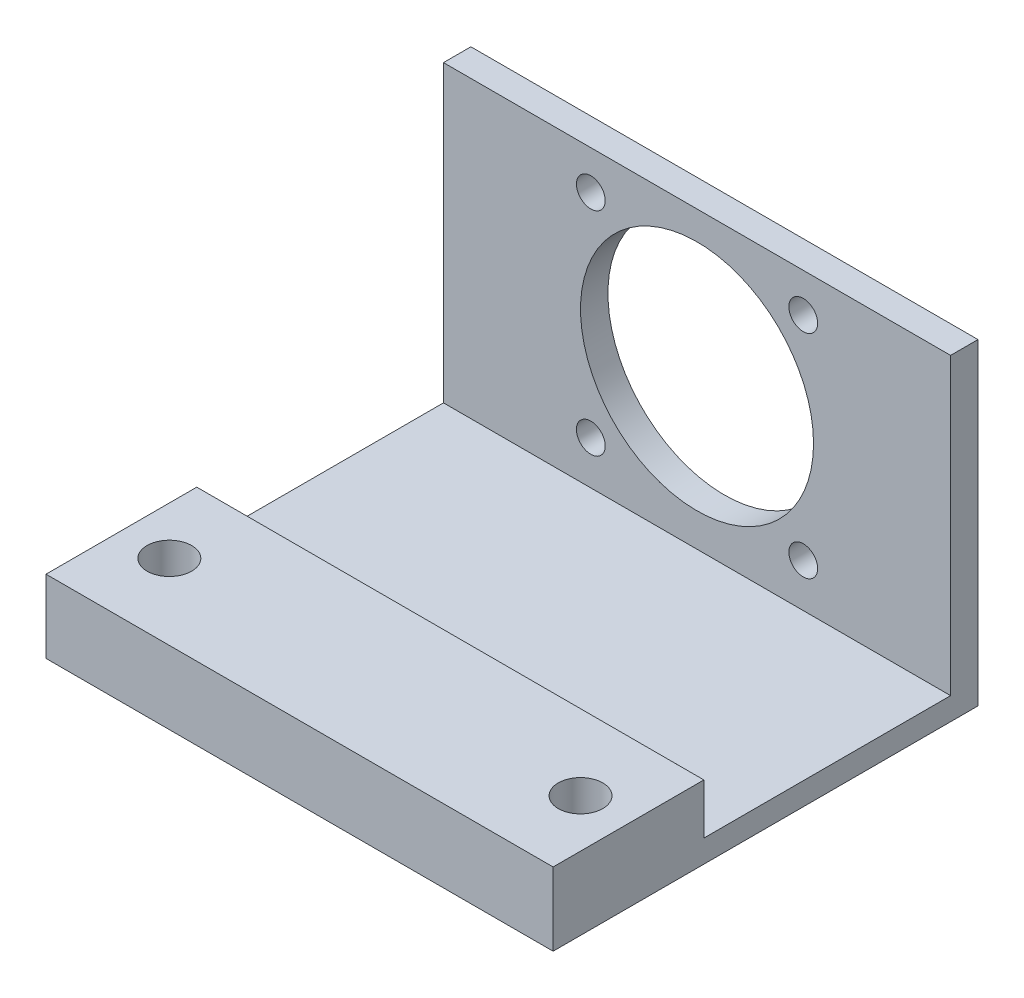
ISO-10303-21;
HEADER;
FILE_DESCRIPTION(('STEP AP214'),'2;1');
FILE_NAME('part.step','',(''),(''),'','','');
FILE_SCHEMA(('AUTOMOTIVE_DESIGN { 1 0 10303 214 1 1 1 1 }'));
ENDSEC;
DATA;
#1=APPLICATION_CONTEXT('core data for automotive mechanical design processes');
#2=APPLICATION_PROTOCOL_DEFINITION('international standard','automotive_design',2000,#1);
#3=PRODUCT_CONTEXT('',#1,'mechanical');
#4=PRODUCT('Part','Part','',(#3));
#5=PRODUCT_RELATED_PRODUCT_CATEGORY('part','',(#4));
#6=PRODUCT_DEFINITION_FORMATION('','',#4);
#7=PRODUCT_DEFINITION_CONTEXT('part definition',#1,'design');
#8=PRODUCT_DEFINITION('design','',#6,#7);
#9=PRODUCT_DEFINITION_SHAPE('','',#8);
#10=(LENGTH_UNIT() NAMED_UNIT(*) SI_UNIT(.MILLI.,.METRE.));
#11=(NAMED_UNIT(*) PLANE_ANGLE_UNIT() SI_UNIT($,.RADIAN.));
#12=(NAMED_UNIT(*) SI_UNIT($,.STERADIAN.) SOLID_ANGLE_UNIT());
#13=UNCERTAINTY_MEASURE_WITH_UNIT(LENGTH_MEASURE(1.E-05),#10,'distance_accuracy_value','');
#14=(GEOMETRIC_REPRESENTATION_CONTEXT(3) GLOBAL_UNCERTAINTY_ASSIGNED_CONTEXT((#13)) GLOBAL_UNIT_ASSIGNED_CONTEXT((#10,
#11,#12)) REPRESENTATION_CONTEXT('',''));
#15=CARTESIAN_POINT('',(0.,0.,0.));
#16=DIRECTION('',(0.,0.,1.));
#17=DIRECTION('',(1.,0.,0.));
#18=AXIS2_PLACEMENT_3D('',#15,#16,#17);
#19=CARTESIAN_POINT('',(0.,0.,4.));
#20=DIRECTION('',(0.,0.,-1.));
#21=DIRECTION('',(-1.,0.,0.));
#22=AXIS2_PLACEMENT_3D('',#19,#20,#21);
#23=PLANE('',#22);
#24=CARTESIAN_POINT('',(15.5,15.5,4.));
#25=DIRECTION('',(0.,0.,1.));
#26=DIRECTION('',(1.,0.,0.));
#27=AXIS2_PLACEMENT_3D('',#24,#25,#26);
#28=CIRCLE('',#27,2.1);
#29=CARTESIAN_POINT('',(17.6,15.5,4.));
#30=VERTEX_POINT('',#29);
#31=EDGE_CURVE('E139',#30,#30,#28,.T.);
#32=ORIENTED_EDGE('',*,*,#31,.F.);
#33=EDGE_LOOP('',(#32));
#34=FACE_BOUND('',#33,.T.);
#35=CARTESIAN_POINT('',(15.5,-15.5,4.));
#36=DIRECTION('',(0.,0.,1.));
#37=DIRECTION('',(-1.,0.,0.));
#38=AXIS2_PLACEMENT_3D('',#35,#36,#37);
#39=CIRCLE('',#38,2.1);
#40=CARTESIAN_POINT('',(13.4,-15.5,4.));
#41=VERTEX_POINT('',#40);
#42=EDGE_CURVE('E146',#41,#41,#39,.T.);
#43=ORIENTED_EDGE('',*,*,#42,.F.);
#44=EDGE_LOOP('',(#43));
#45=FACE_BOUND('',#44,.T.);
#46=CARTESIAN_POINT('',(-15.5,15.5,4.));
#47=DIRECTION('',(0.,0.,1.));
#48=DIRECTION('',(-1.,0.,0.));
#49=AXIS2_PLACEMENT_3D('',#46,#47,#48);
#50=CIRCLE('',#49,2.1);
#51=CARTESIAN_POINT('',(-17.6,15.5,4.));
#52=VERTEX_POINT('',#51);
#53=EDGE_CURVE('E152',#52,#52,#50,.T.);
#54=ORIENTED_EDGE('',*,*,#53,.F.);
#55=EDGE_LOOP('',(#54));
#56=FACE_BOUND('',#55,.T.);
#57=CARTESIAN_POINT('',(-15.5,-15.5,4.));
#58=DIRECTION('',(0.,0.,1.));
#59=DIRECTION('',(1.,0.,0.));
#60=AXIS2_PLACEMENT_3D('',#57,#58,#59);
#61=CIRCLE('',#60,2.1);
#62=CARTESIAN_POINT('',(-13.4,-15.5,4.));
#63=VERTEX_POINT('',#62);
#64=EDGE_CURVE('E158',#63,#63,#61,.T.);
#65=ORIENTED_EDGE('',*,*,#64,.F.);
#66=EDGE_LOOP('',(#65));
#67=FACE_BOUND('',#66,.T.);
#68=CARTESIAN_POINT('',(0.,0.,4.));
#69=DIRECTION('',(0.,0.,1.));
#70=DIRECTION('',(1.,0.,0.));
#71=AXIS2_PLACEMENT_3D('',#68,#69,#70);
#72=CIRCLE('',#71,17.);
#73=CARTESIAN_POINT('',(17.,0.,4.));
#74=VERTEX_POINT('',#73);
#75=EDGE_CURVE('E95',#74,#74,#72,.T.);
#76=ORIENTED_EDGE('',*,*,#75,.F.);
#77=EDGE_LOOP('',(#76));
#78=FACE_BOUND('',#77,.T.);
#79=DIRECTION('',(-1.,0.,0.));
#80=VECTOR('',#79,1.);
#81=CARTESIAN_POINT('',(37.,-21.85,3.99999999999998));
#82=LINE('',#81,#80);
#83=CARTESIAN_POINT('',(37.,-21.85,4.));
#84=VERTEX_POINT('',#83);
#85=CARTESIAN_POINT('',(-37.,-21.85,3.99999999999998));
#86=VERTEX_POINT('',#85);
#87=EDGE_CURVE('E48',#84,#86,#82,.T.);
#88=ORIENTED_EDGE('',*,*,#87,.F.);
#89=DIRECTION('',(0.,1.,0.));
#90=VECTOR('',#89,1.);
#91=CARTESIAN_POINT('',(37.,21.15,4.));
#92=LINE('',#91,#90);
#93=CARTESIAN_POINT('',(37.,21.15,4.));
#94=VERTEX_POINT('',#93);
#95=EDGE_CURVE('E165',#84,#94,#92,.T.);
#96=ORIENTED_EDGE('',*,*,#95,.T.);
#97=DIRECTION('',(-1.,0.,0.));
#98=VECTOR('',#97,1.);
#99=CARTESIAN_POINT('',(37.,21.15,4.));
#100=LINE('',#99,#98);
#101=CARTESIAN_POINT('',(-37.,21.15,4.));
#102=VERTEX_POINT('',#101);
#103=EDGE_CURVE('E54',#94,#102,#100,.T.);
#104=ORIENTED_EDGE('',*,*,#103,.T.);
#105=DIRECTION('',(0.,-1.,0.));
#106=VECTOR('',#105,1.);
#107=CARTESIAN_POINT('',(-37.,21.15,4.));
#108=LINE('',#107,#106);
#109=EDGE_CURVE('E83',#102,#86,#108,.T.);
#110=ORIENTED_EDGE('',*,*,#109,.T.);
#111=EDGE_LOOP('',(#88,#96,#104,#110));
#112=FACE_BOUND('',#111,.T.);
#113=ADVANCED_FACE('F33',(#34,#45,#56,#67,#78,#112),#23,.F.);
#114=CARTESIAN_POINT('',(0.,0.,0.));
#115=DIRECTION('',(0.,0.,-1.));
#116=DIRECTION('',(-1.,0.,0.));
#117=AXIS2_PLACEMENT_3D('',#114,#115,#116);
#118=PLANE('',#117);
#119=CARTESIAN_POINT('',(15.5,-15.5,0.));
#120=DIRECTION('',(0.,0.,1.));
#121=DIRECTION('',(-1.,0.,0.));
#122=AXIS2_PLACEMENT_3D('',#119,#120,#121);
#123=CIRCLE('',#122,2.1);
#124=CARTESIAN_POINT('',(13.4,-15.5,0.));
#125=VERTEX_POINT('',#124);
#126=EDGE_CURVE('E142',#125,#125,#123,.T.);
#127=ORIENTED_EDGE('',*,*,#126,.T.);
#128=EDGE_LOOP('',(#127));
#129=FACE_BOUND('',#128,.T.);
#130=CARTESIAN_POINT('',(-15.5,-15.5,0.));
#131=DIRECTION('',(0.,0.,1.));
#132=DIRECTION('',(1.,0.,0.));
#133=AXIS2_PLACEMENT_3D('',#130,#131,#132);
#134=CIRCLE('',#133,2.1);
#135=CARTESIAN_POINT('',(-13.4,-15.5,0.));
#136=VERTEX_POINT('',#135);
#137=EDGE_CURVE('E155',#136,#136,#134,.T.);
#138=ORIENTED_EDGE('',*,*,#137,.T.);
#139=EDGE_LOOP('',(#138));
#140=FACE_BOUND('',#139,.T.);
#141=DIRECTION('',(0.,-1.,0.));
#142=VECTOR('',#141,1.);
#143=CARTESIAN_POINT('',(-37.,21.15,0.));
#144=LINE('',#143,#142);
#145=CARTESIAN_POINT('',(-37.,21.15,0.));
#146=VERTEX_POINT('',#145);
#147=CARTESIAN_POINT('',(-37.,-25.15,0.));
#148=VERTEX_POINT('',#147);
#149=EDGE_CURVE('E89',#146,#148,#144,.T.);
#150=ORIENTED_EDGE('',*,*,#149,.F.);
#151=DIRECTION('',(-1.,0.,0.));
#152=VECTOR('',#151,1.);
#153=CARTESIAN_POINT('',(37.,21.15,0.));
#154=LINE('',#153,#152);
#155=CARTESIAN_POINT('',(37.,21.15,0.));
#156=VERTEX_POINT('',#155);
#157=EDGE_CURVE('E73',#156,#146,#154,.T.);
#158=ORIENTED_EDGE('',*,*,#157,.F.);
#159=DIRECTION('',(0.,1.,0.));
#160=VECTOR('',#159,1.);
#161=CARTESIAN_POINT('',(37.,21.15,0.));
#162=LINE('',#161,#160);
#163=CARTESIAN_POINT('',(37.,-25.15,0.));
#164=VERTEX_POINT('',#163);
#165=EDGE_CURVE('E84',#164,#156,#162,.T.);
#166=ORIENTED_EDGE('',*,*,#165,.F.);
#167=DIRECTION('',(1.,0.,0.));
#168=VECTOR('',#167,1.);
#169=CARTESIAN_POINT('',(37.,-25.15,0.));
#170=LINE('',#169,#168);
#171=EDGE_CURVE('E94',#148,#164,#170,.T.);
#172=ORIENTED_EDGE('',*,*,#171,.F.);
#173=EDGE_LOOP('',(#150,#158,#166,#172));
#174=FACE_BOUND('',#173,.T.);
#175=CARTESIAN_POINT('',(0.,0.,0.));
#176=DIRECTION('',(0.,0.,1.));
#177=DIRECTION('',(1.,0.,0.));
#178=AXIS2_PLACEMENT_3D('',#175,#176,#177);
#179=CIRCLE('',#178,17.);
#180=CARTESIAN_POINT('',(17.,0.,0.));
#181=VERTEX_POINT('',#180);
#182=EDGE_CURVE('E99',#181,#181,#179,.T.);
#183=ORIENTED_EDGE('',*,*,#182,.T.);
#184=EDGE_LOOP('',(#183));
#185=FACE_BOUND('',#184,.T.);
#186=CARTESIAN_POINT('',(-15.5,15.5,0.));
#187=DIRECTION('',(0.,0.,1.));
#188=DIRECTION('',(-1.,0.,0.));
#189=AXIS2_PLACEMENT_3D('',#186,#187,#188);
#190=CIRCLE('',#189,2.1);
#191=CARTESIAN_POINT('',(-17.6,15.5,0.));
#192=VERTEX_POINT('',#191);
#193=EDGE_CURVE('E149',#192,#192,#190,.T.);
#194=ORIENTED_EDGE('',*,*,#193,.T.);
#195=EDGE_LOOP('',(#194));
#196=FACE_BOUND('',#195,.T.);
#197=CARTESIAN_POINT('',(15.5,15.5,0.));
#198=DIRECTION('',(0.,0.,1.));
#199=DIRECTION('',(1.,0.,0.));
#200=AXIS2_PLACEMENT_3D('',#197,#198,#199);
#201=CIRCLE('',#200,2.1);
#202=CARTESIAN_POINT('',(17.6,15.5,0.));
#203=VERTEX_POINT('',#202);
#204=EDGE_CURVE('E143',#203,#203,#201,.T.);
#205=ORIENTED_EDGE('',*,*,#204,.T.);
#206=EDGE_LOOP('',(#205));
#207=FACE_BOUND('',#206,.T.);
#208=ADVANCED_FACE('F92',(#129,#140,#174,#185,#196,#207),#118,.T.);
#209=CARTESIAN_POINT('',(-37.,21.15,4.));
#210=DIRECTION('',(1.,0.,0.));
#211=DIRECTION('',(0.,0.,-1.));
#212=AXIS2_PLACEMENT_3D('',#209,#210,#211);
#213=PLANE('',#212);
#214=ORIENTED_EDGE('',*,*,#149,.T.);
#215=DIRECTION('',(0.,0.,-1.));
#216=VECTOR('',#215,1.);
#217=CARTESIAN_POINT('',(-37.,-25.15,4.));
#218=LINE('',#217,#216);
#219=CARTESIAN_POINT('',(-37.,-25.15,62.));
#220=VERTEX_POINT('',#219);
#221=EDGE_CURVE('E11',#220,#148,#218,.T.);
#222=ORIENTED_EDGE('',*,*,#221,.F.);
#223=DIRECTION('',(0.,1.,0.));
#224=VECTOR('',#223,1.);
#225=CARTESIAN_POINT('',(-37.,-25.15,62.));
#226=LINE('',#225,#224);
#227=CARTESIAN_POINT('',(-37.,-14.5,62.));
#228=VERTEX_POINT('',#227);
#229=EDGE_CURVE('E128',#220,#228,#226,.T.);
#230=ORIENTED_EDGE('',*,*,#229,.T.);
#231=DIRECTION('',(0.,0.,-1.));
#232=VECTOR('',#231,1.);
#233=CARTESIAN_POINT('',(-37.,-14.5,62.));
#234=LINE('',#233,#232);
#235=CARTESIAN_POINT('',(-37.,-14.5,40.));
#236=VERTEX_POINT('',#235);
#237=EDGE_CURVE('E193',#228,#236,#234,.T.);
#238=ORIENTED_EDGE('',*,*,#237,.T.);
#239=DIRECTION('',(0.,-1.,0.));
#240=VECTOR('',#239,1.);
#241=CARTESIAN_POINT('',(-37.,-14.5,40.));
#242=LINE('',#241,#240);
#243=CARTESIAN_POINT('',(-37.,-21.85,40.));
#244=VERTEX_POINT('',#243);
#245=EDGE_CURVE('E197',#236,#244,#242,.T.);
#246=ORIENTED_EDGE('',*,*,#245,.T.);
#247=DIRECTION('',(0.,0.,-1.));
#248=VECTOR('',#247,1.);
#249=CARTESIAN_POINT('',(-37.,-21.85,3.99999999999998));
#250=LINE('',#249,#248);
#251=EDGE_CURVE('E176',#244,#86,#250,.T.);
#252=ORIENTED_EDGE('',*,*,#251,.T.);
#253=ORIENTED_EDGE('',*,*,#109,.F.);
#254=DIRECTION('',(0.,0.,-1.));
#255=VECTOR('',#254,1.);
#256=CARTESIAN_POINT('',(-37.,21.15,4.));
#257=LINE('',#256,#255);
#258=EDGE_CURVE('E76',#102,#146,#257,.T.);
#259=ORIENTED_EDGE('',*,*,#258,.T.);
#260=EDGE_LOOP('',(#214,#222,#230,#238,#246,#252,#253,#259));
#261=FACE_BOUND('',#260,.T.);
#262=ADVANCED_FACE('F35',(#261),#213,.F.);
#263=CARTESIAN_POINT('',(37.,-25.15,4.));
#264=DIRECTION('',(0.,1.,0.));
#265=DIRECTION('',(0.,0.,1.));
#266=AXIS2_PLACEMENT_3D('',#263,#264,#265);
#267=PLANE('',#266);
#268=CARTESIAN_POINT('',(-30.,-25.15,51.));
#269=DIRECTION('',(0.,1.,0.));
#270=DIRECTION('',(0.,0.,1.));
#271=AXIS2_PLACEMENT_3D('',#268,#269,#270);
#272=CIRCLE('',#271,3.25);
#273=CARTESIAN_POINT('',(-30.,-25.15,54.25));
#274=VERTEX_POINT('',#273);
#275=EDGE_CURVE('E194',#274,#274,#272,.F.);
#276=ORIENTED_EDGE('',*,*,#275,.F.);
#277=EDGE_LOOP('',(#276));
#278=FACE_BOUND('',#277,.T.);
#279=CARTESIAN_POINT('',(30.,-25.15,51.));
#280=DIRECTION('',(0.,1.,0.));
#281=DIRECTION('',(0.,0.,1.));
#282=AXIS2_PLACEMENT_3D('',#279,#280,#281);
#283=CIRCLE('',#282,3.25);
#284=CARTESIAN_POINT('',(30.,-25.15,54.25));
#285=VERTEX_POINT('',#284);
#286=EDGE_CURVE('E251',#285,#285,#283,.F.);
#287=ORIENTED_EDGE('',*,*,#286,.F.);
#288=EDGE_LOOP('',(#287));
#289=FACE_BOUND('',#288,.T.);
#290=ORIENTED_EDGE('',*,*,#171,.T.);
#291=DIRECTION('',(0.,0.,-1.));
#292=VECTOR('',#291,1.);
#293=CARTESIAN_POINT('',(37.,-25.15,4.));
#294=LINE('',#293,#292);
#295=CARTESIAN_POINT('',(37.,-25.15,62.));
#296=VERTEX_POINT('',#295);
#297=EDGE_CURVE('E41',#296,#164,#294,.T.);
#298=ORIENTED_EDGE('',*,*,#297,.F.);
#299=DIRECTION('',(-1.,0.,0.));
#300=VECTOR('',#299,1.);
#301=CARTESIAN_POINT('',(37.,-25.15,62.));
#302=LINE('',#301,#300);
#303=EDGE_CURVE('E119',#296,#220,#302,.T.);
#304=ORIENTED_EDGE('',*,*,#303,.T.);
#305=ORIENTED_EDGE('',*,*,#221,.T.);
#306=EDGE_LOOP('',(#290,#298,#304,#305));
#307=FACE_BOUND('',#306,.T.);
#308=ADVANCED_FACE('F117',(#278,#289,#307),#267,.F.);
#309=CARTESIAN_POINT('',(37.,21.15,4.));
#310=DIRECTION('',(-1.,0.,0.));
#311=DIRECTION('',(0.,0.,1.));
#312=AXIS2_PLACEMENT_3D('',#309,#310,#311);
#313=PLANE('',#312);
#314=ORIENTED_EDGE('',*,*,#165,.T.);
#315=DIRECTION('',(0.,0.,-1.));
#316=VECTOR('',#315,1.);
#317=CARTESIAN_POINT('',(37.,21.15,4.));
#318=LINE('',#317,#316);
#319=EDGE_CURVE('E79',#94,#156,#318,.T.);
#320=ORIENTED_EDGE('',*,*,#319,.F.);
#321=ORIENTED_EDGE('',*,*,#95,.F.);
#322=DIRECTION('',(0.,0.,-1.));
#323=VECTOR('',#322,1.);
#324=CARTESIAN_POINT('',(37.,-21.85,3.99999999999998));
#325=LINE('',#324,#323);
#326=CARTESIAN_POINT('',(37.,-21.85,40.));
#327=VERTEX_POINT('',#326);
#328=EDGE_CURVE('E130',#327,#84,#325,.T.);
#329=ORIENTED_EDGE('',*,*,#328,.F.);
#330=DIRECTION('',(0.,-1.,0.));
#331=VECTOR('',#330,1.);
#332=CARTESIAN_POINT('',(37.,-14.5,40.));
#333=LINE('',#332,#331);
#334=CARTESIAN_POINT('',(37.,-14.5,40.));
#335=VERTEX_POINT('',#334);
#336=EDGE_CURVE('E135',#335,#327,#333,.T.);
#337=ORIENTED_EDGE('',*,*,#336,.F.);
#338=DIRECTION('',(0.,0.,-1.));
#339=VECTOR('',#338,1.);
#340=CARTESIAN_POINT('',(37.,-14.5,62.));
#341=LINE('',#340,#339);
#342=CARTESIAN_POINT('',(37.,-14.5,62.));
#343=VERTEX_POINT('',#342);
#344=EDGE_CURVE('E187',#343,#335,#341,.T.);
#345=ORIENTED_EDGE('',*,*,#344,.F.);
#346=DIRECTION('',(0.,1.,0.));
#347=VECTOR('',#346,1.);
#348=CARTESIAN_POINT('',(37.,-25.15,62.));
#349=LINE('',#348,#347);
#350=EDGE_CURVE('E113',#296,#343,#349,.T.);
#351=ORIENTED_EDGE('',*,*,#350,.F.);
#352=ORIENTED_EDGE('',*,*,#297,.T.);
#353=EDGE_LOOP('',(#314,#320,#321,#329,#337,#345,#351,#352));
#354=FACE_BOUND('',#353,.T.);
#355=ADVANCED_FACE('F109',(#354),#313,.F.);
#356=CARTESIAN_POINT('',(37.,21.15,4.));
#357=DIRECTION('',(0.,-1.,0.));
#358=DIRECTION('',(0.,0.,-1.));
#359=AXIS2_PLACEMENT_3D('',#356,#357,#358);
#360=PLANE('',#359);
#361=ORIENTED_EDGE('',*,*,#157,.T.);
#362=ORIENTED_EDGE('',*,*,#258,.F.);
#363=ORIENTED_EDGE('',*,*,#103,.F.);
#364=ORIENTED_EDGE('',*,*,#319,.T.);
#365=EDGE_LOOP('',(#361,#362,#363,#364));
#366=FACE_BOUND('',#365,.T.);
#367=ADVANCED_FACE('F75',(#366),#360,.F.);
#368=CARTESIAN_POINT('',(0.,0.,4.));
#369=DIRECTION('',(0.,0.,-1.));
#370=DIRECTION('',(-1.,0.,0.));
#371=AXIS2_PLACEMENT_3D('',#368,#369,#370);
#372=CYLINDRICAL_SURFACE('',#371,17.);
#373=ORIENTED_EDGE('',*,*,#75,.T.);
#374=EDGE_LOOP('',(#373));
#375=FACE_BOUND('',#374,.T.);
#376=ORIENTED_EDGE('',*,*,#182,.F.);
#377=EDGE_LOOP('',(#376));
#378=FACE_BOUND('',#377,.T.);
#379=ADVANCED_FACE('F235',(#375,#378),#372,.F.);
#380=CARTESIAN_POINT('',(-15.5,-15.5,4.));
#381=DIRECTION('',(0.,0.,-1.));
#382=DIRECTION('',(-1.,0.,0.));
#383=AXIS2_PLACEMENT_3D('',#380,#381,#382);
#384=CYLINDRICAL_SURFACE('',#383,2.1);
#385=ORIENTED_EDGE('',*,*,#64,.T.);
#386=EDGE_LOOP('',(#385));
#387=FACE_BOUND('',#386,.T.);
#388=ORIENTED_EDGE('',*,*,#137,.F.);
#389=EDGE_LOOP('',(#388));
#390=FACE_BOUND('',#389,.T.);
#391=ADVANCED_FACE('F289',(#387,#390),#384,.F.);
#392=CARTESIAN_POINT('',(-15.5,15.5,4.));
#393=DIRECTION('',(0.,0.,-1.));
#394=DIRECTION('',(-1.,0.,0.));
#395=AXIS2_PLACEMENT_3D('',#392,#393,#394);
#396=CYLINDRICAL_SURFACE('',#395,2.1);
#397=ORIENTED_EDGE('',*,*,#53,.T.);
#398=EDGE_LOOP('',(#397));
#399=FACE_BOUND('',#398,.T.);
#400=ORIENTED_EDGE('',*,*,#193,.F.);
#401=EDGE_LOOP('',(#400));
#402=FACE_BOUND('',#401,.T.);
#403=ADVANCED_FACE('F283',(#399,#402),#396,.F.);
#404=CARTESIAN_POINT('',(15.5,-15.5,4.));
#405=DIRECTION('',(0.,0.,-1.));
#406=DIRECTION('',(-1.,0.,0.));
#407=AXIS2_PLACEMENT_3D('',#404,#405,#406);
#408=CYLINDRICAL_SURFACE('',#407,2.1);
#409=ORIENTED_EDGE('',*,*,#42,.T.);
#410=EDGE_LOOP('',(#409));
#411=FACE_BOUND('',#410,.T.);
#412=ORIENTED_EDGE('',*,*,#126,.F.);
#413=EDGE_LOOP('',(#412));
#414=FACE_BOUND('',#413,.T.);
#415=ADVANCED_FACE('F277',(#411,#414),#408,.F.);
#416=CARTESIAN_POINT('',(15.5,15.5,4.));
#417=DIRECTION('',(0.,0.,-1.));
#418=DIRECTION('',(-1.,0.,0.));
#419=AXIS2_PLACEMENT_3D('',#416,#417,#418);
#420=CYLINDRICAL_SURFACE('',#419,2.1);
#421=ORIENTED_EDGE('',*,*,#31,.T.);
#422=EDGE_LOOP('',(#421));
#423=FACE_BOUND('',#422,.T.);
#424=ORIENTED_EDGE('',*,*,#204,.F.);
#425=EDGE_LOOP('',(#424));
#426=FACE_BOUND('',#425,.T.);
#427=ADVANCED_FACE('F273',(#423,#426),#420,.F.);
#428=CARTESIAN_POINT('',(37.,-21.85,3.99999999999998));
#429=DIRECTION('',(0.,1.,0.));
#430=DIRECTION('',(0.,0.,1.));
#431=AXIS2_PLACEMENT_3D('',#428,#429,#430);
#432=PLANE('',#431);
#433=ORIENTED_EDGE('',*,*,#251,.F.);
#434=DIRECTION('',(-1.,0.,0.));
#435=VECTOR('',#434,1.);
#436=CARTESIAN_POINT('',(37.,-21.85,40.));
#437=LINE('',#436,#435);
#438=EDGE_CURVE('E173',#327,#244,#437,.T.);
#439=ORIENTED_EDGE('',*,*,#438,.F.);
#440=ORIENTED_EDGE('',*,*,#328,.T.);
#441=ORIENTED_EDGE('',*,*,#87,.T.);
#442=EDGE_LOOP('',(#433,#439,#440,#441));
#443=FACE_BOUND('',#442,.T.);
#444=ADVANCED_FACE('F171',(#443),#432,.T.);
#445=CARTESIAN_POINT('',(37.,-14.5,40.));
#446=DIRECTION('',(0.,0.,-1.));
#447=DIRECTION('',(-1.,0.,0.));
#448=AXIS2_PLACEMENT_3D('',#445,#446,#447);
#449=PLANE('',#448);
#450=ORIENTED_EDGE('',*,*,#245,.F.);
#451=DIRECTION('',(-1.,0.,0.));
#452=VECTOR('',#451,1.);
#453=CARTESIAN_POINT('',(37.,-14.5,40.));
#454=LINE('',#453,#452);
#455=EDGE_CURVE('E132',#335,#236,#454,.T.);
#456=ORIENTED_EDGE('',*,*,#455,.F.);
#457=ORIENTED_EDGE('',*,*,#336,.T.);
#458=ORIENTED_EDGE('',*,*,#438,.T.);
#459=EDGE_LOOP('',(#450,#456,#457,#458));
#460=FACE_BOUND('',#459,.T.);
#461=ADVANCED_FACE('F184',(#460),#449,.T.);
#462=CARTESIAN_POINT('',(37.,-14.5,62.));
#463=DIRECTION('',(0.,1.,0.));
#464=DIRECTION('',(0.,0.,1.));
#465=AXIS2_PLACEMENT_3D('',#462,#463,#464);
#466=PLANE('',#465);
#467=CARTESIAN_POINT('',(-30.,-14.5,51.));
#468=DIRECTION('',(0.,1.,0.));
#469=DIRECTION('',(0.,0.,1.));
#470=AXIS2_PLACEMENT_3D('',#467,#468,#469);
#471=CIRCLE('',#470,3.25);
#472=CARTESIAN_POINT('',(-30.,-14.5,54.25));
#473=VERTEX_POINT('',#472);
#474=EDGE_CURVE('E253',#473,#473,#471,.T.);
#475=ORIENTED_EDGE('',*,*,#474,.F.);
#476=EDGE_LOOP('',(#475));
#477=FACE_BOUND('',#476,.T.);
#478=CARTESIAN_POINT('',(30.,-14.5,51.));
#479=DIRECTION('',(0.,1.,0.));
#480=DIRECTION('',(0.,0.,1.));
#481=AXIS2_PLACEMENT_3D('',#478,#479,#480);
#482=CIRCLE('',#481,3.25);
#483=CARTESIAN_POINT('',(30.,-14.5,54.25));
#484=VERTEX_POINT('',#483);
#485=EDGE_CURVE('E254',#484,#484,#482,.T.);
#486=ORIENTED_EDGE('',*,*,#485,.F.);
#487=EDGE_LOOP('',(#486));
#488=FACE_BOUND('',#487,.T.);
#489=ORIENTED_EDGE('',*,*,#237,.F.);
#490=DIRECTION('',(-1.,0.,0.));
#491=VECTOR('',#490,1.);
#492=CARTESIAN_POINT('',(37.,-14.5,62.));
#493=LINE('',#492,#491);
#494=EDGE_CURVE('E129',#343,#228,#493,.T.);
#495=ORIENTED_EDGE('',*,*,#494,.F.);
#496=ORIENTED_EDGE('',*,*,#344,.T.);
#497=ORIENTED_EDGE('',*,*,#455,.T.);
#498=EDGE_LOOP('',(#489,#495,#496,#497));
#499=FACE_BOUND('',#498,.T.);
#500=ADVANCED_FACE('F203',(#477,#488,#499),#466,.T.);
#501=CARTESIAN_POINT('',(37.,-25.15,62.));
#502=DIRECTION('',(0.,0.,1.));
#503=DIRECTION('',(0.,-1.,0.));
#504=AXIS2_PLACEMENT_3D('',#501,#502,#503);
#505=PLANE('',#504);
#506=ORIENTED_EDGE('',*,*,#229,.F.);
#507=ORIENTED_EDGE('',*,*,#303,.F.);
#508=ORIENTED_EDGE('',*,*,#350,.T.);
#509=ORIENTED_EDGE('',*,*,#494,.T.);
#510=EDGE_LOOP('',(#506,#507,#508,#509));
#511=FACE_BOUND('',#510,.T.);
#512=ADVANCED_FACE('F125',(#511),#505,.T.);
#513=CARTESIAN_POINT('',(30.,-25.151,51.));
#514=DIRECTION('',(0.,1.,0.));
#515=DIRECTION('',(0.,0.,1.));
#516=AXIS2_PLACEMENT_3D('',#513,#514,#515);
#517=CYLINDRICAL_SURFACE('',#516,3.25);
#518=ORIENTED_EDGE('',*,*,#485,.T.);
#519=EDGE_LOOP('',(#518));
#520=FACE_BOUND('',#519,.T.);
#521=ORIENTED_EDGE('',*,*,#286,.T.);
#522=EDGE_LOOP('',(#521));
#523=FACE_BOUND('',#522,.T.);
#524=ADVANCED_FACE('F219',(#520,#523),#517,.F.);
#525=CARTESIAN_POINT('',(-30.,-25.151,51.));
#526=DIRECTION('',(0.,1.,0.));
#527=DIRECTION('',(0.,0.,1.));
#528=AXIS2_PLACEMENT_3D('',#525,#526,#527);
#529=CYLINDRICAL_SURFACE('',#528,3.25);
#530=ORIENTED_EDGE('',*,*,#474,.T.);
#531=EDGE_LOOP('',(#530));
#532=FACE_BOUND('',#531,.T.);
#533=ORIENTED_EDGE('',*,*,#275,.T.);
#534=EDGE_LOOP('',(#533));
#535=FACE_BOUND('',#534,.T.);
#536=ADVANCED_FACE('F262',(#532,#535),#529,.F.);
#537=CLOSED_SHELL('',(#113,#208,#262,#308,#355,#367,#379,#391,#403,#415,#427,#444,#461,#500,
#512,#524,#536));
#538=MANIFOLD_SOLID_BREP('B2',#537);
#539=ADVANCED_BREP_SHAPE_REPRESENTATION('',(#18,#538),#14);
#540=SHAPE_DEFINITION_REPRESENTATION(#9,#539);
ENDSEC;
END-ISO-10303-21;
